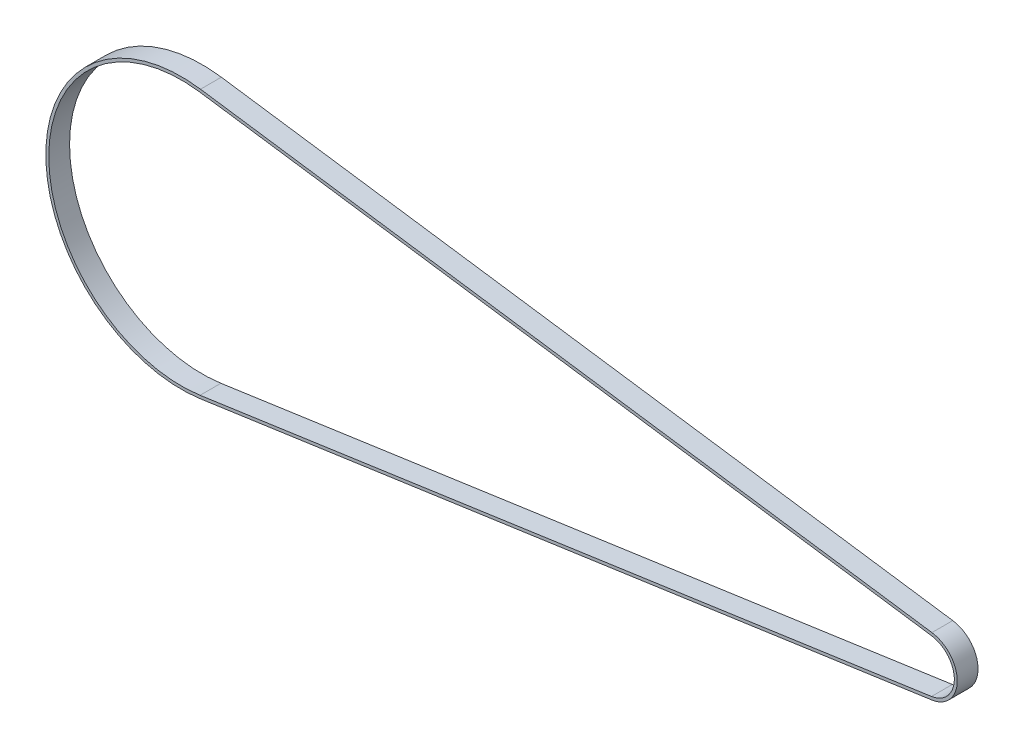
ISO-10303-21;
HEADER;
FILE_DESCRIPTION(('STEP AP214'),'2;1');
FILE_NAME('part.step','',(''),(''),'','','');
FILE_SCHEMA(('AUTOMOTIVE_DESIGN { 1 0 10303 214 1 1 1 1 }'));
ENDSEC;
DATA;
#1=APPLICATION_CONTEXT('core data for automotive mechanical design processes');
#2=APPLICATION_PROTOCOL_DEFINITION('international standard','automotive_design',2000,#1);
#3=PRODUCT_CONTEXT('',#1,'mechanical');
#4=PRODUCT('Part','Part','',(#3));
#5=PRODUCT_RELATED_PRODUCT_CATEGORY('part','',(#4));
#6=PRODUCT_DEFINITION_FORMATION('','',#4);
#7=PRODUCT_DEFINITION_CONTEXT('part definition',#1,'design');
#8=PRODUCT_DEFINITION('design','',#6,#7);
#9=PRODUCT_DEFINITION_SHAPE('','',#8);
#10=(LENGTH_UNIT() NAMED_UNIT(*) SI_UNIT(.MILLI.,.METRE.));
#11=(NAMED_UNIT(*) PLANE_ANGLE_UNIT() SI_UNIT($,.RADIAN.));
#12=(NAMED_UNIT(*) SI_UNIT($,.STERADIAN.) SOLID_ANGLE_UNIT());
#13=UNCERTAINTY_MEASURE_WITH_UNIT(LENGTH_MEASURE(1.E-05),#10,'distance_accuracy_value','');
#14=(GEOMETRIC_REPRESENTATION_CONTEXT(3) GLOBAL_UNCERTAINTY_ASSIGNED_CONTEXT((#13)) GLOBAL_UNIT_ASSIGNED_CONTEXT((#10,
#11,#12)) REPRESENTATION_CONTEXT('',''));
#15=CARTESIAN_POINT('',(0.,0.,0.));
#16=DIRECTION('',(0.,0.,1.));
#17=DIRECTION('',(1.,0.,0.));
#18=AXIS2_PLACEMENT_3D('',#15,#16,#17);
#19=CARTESIAN_POINT('',(-3.38618022510673E-12,4.9960036108132E-13,14.224));
#20=DIRECTION('',(0.,0.,-1.));
#21=DIRECTION('',(-1.,0.,0.));
#22=AXIS2_PLACEMENT_3D('',#19,#20,#21);
#23=PLANE('',#22);
#24=CARTESIAN_POINT('',(-3.38618022510673E-12,4.9960036108132E-13,14.224));
#25=DIRECTION('',(0.,0.,-1.));
#26=DIRECTION('',(-1.,0.,0.));
#27=AXIS2_PLACEMENT_3D('',#24,#25,#26);
#28=CIRCLE('',#27,20.161);
#29=CARTESIAN_POINT('',(2.86167605882014,-19.9568717772685,14.224));
#30=VERTEX_POINT('',#29);
#31=CARTESIAN_POINT('',(2.86167605882032,19.9568717772695,14.224));
#32=VERTEX_POINT('',#31);
#33=EDGE_CURVE('E160',#30,#32,#28,.F.);
#34=ORIENTED_EDGE('',*,*,#33,.T.);
#35=DIRECTION('',(-0.989875094353902,0.141941176470589,0.));
#36=VECTOR('',#35,1.);
#37=CARTESIAN_POINT('',(2.86167605882015,19.9568717772695,14.224));
#38=LINE('',#37,#36);
#39=CARTESIAN_POINT('',(-496.863202176473,91.6139298575486,14.224));
#40=VERTEX_POINT('',#39);
#41=EDGE_CURVE('E163',#32,#40,#38,.T.);
#42=ORIENTED_EDGE('',*,*,#41,.T.);
#43=CARTESIAN_POINT('',(-510.000000000003,6.66133814775094E-13,14.224));
#44=DIRECTION('',(0.,0.,-1.));
#45=DIRECTION('',(-1.,0.,0.));
#46=AXIS2_PLACEMENT_3D('',#43,#44,#45);
#47=CIRCLE('',#46,92.551);
#48=CARTESIAN_POINT('',(-496.863202176474,-91.6139298575473,14.224));
#49=VERTEX_POINT('',#48);
#50=EDGE_CURVE('E166',#40,#49,#47,.F.);
#51=ORIENTED_EDGE('',*,*,#50,.T.);
#52=DIRECTION('',(0.989875094353902,0.141941176470588,0.));
#53=VECTOR('',#52,1.);
#54=CARTESIAN_POINT('',(2.86167605882014,-19.9568717772685,14.224));
#55=LINE('',#54,#53);
#56=EDGE_CURVE('E168',#49,#30,#55,.T.);
#57=ORIENTED_EDGE('',*,*,#56,.T.);
#58=EDGE_LOOP('',(#34,#42,#51,#57));
#59=FACE_BOUND('',#58,.T.);
#60=CARTESIAN_POINT('',(-3.38618022510673E-12,4.9960036108132E-13,14.224));
#61=DIRECTION('',(0.,0.,1.));
#62=DIRECTION('',(-1.,0.,0.));
#63=AXIS2_PLACEMENT_3D('',#60,#61,#62);
#64=CIRCLE('',#63,18.161);
#65=CARTESIAN_POINT('',(2.57779370587896,-17.9771215885607,14.224));
#66=VERTEX_POINT('',#65);
#67=CARTESIAN_POINT('',(2.57779370587897,17.9771215885617,14.224));
#68=VERTEX_POINT('',#67);
#69=EDGE_CURVE('E124',#66,#68,#64,.T.);
#70=ORIENTED_EDGE('',*,*,#69,.F.);
#71=DIRECTION('',(0.989875094353902,0.141941176470588,0.));
#72=VECTOR('',#71,1.);
#73=CARTESIAN_POINT('',(2.57779370587896,-17.9771215885607,14.224));
#74=LINE('',#73,#72);
#75=CARTESIAN_POINT('',(-497.147084529415,-89.6341796688395,14.224));
#76=VERTEX_POINT('',#75);
#77=EDGE_CURVE('E146',#76,#66,#74,.T.);
#78=ORIENTED_EDGE('',*,*,#77,.F.);
#79=CARTESIAN_POINT('',(-510.000000000003,6.66133814775094E-13,14.224));
#80=DIRECTION('',(0.,0.,1.));
#81=DIRECTION('',(-1.,0.,0.));
#82=AXIS2_PLACEMENT_3D('',#79,#80,#81);
#83=CIRCLE('',#82,90.551);
#84=CARTESIAN_POINT('',(-497.147084529415,89.6341796688408,14.224));
#85=VERTEX_POINT('',#84);
#86=EDGE_CURVE('E144',#85,#76,#83,.T.);
#87=ORIENTED_EDGE('',*,*,#86,.F.);
#88=DIRECTION('',(-0.989875094353901,0.141941176470589,0.));
#89=VECTOR('',#88,1.);
#90=CARTESIAN_POINT('',(-497.147084529415,89.6341796688408,14.224));
#91=LINE('',#90,#89);
#92=EDGE_CURVE('E132',#68,#85,#91,.T.);
#93=ORIENTED_EDGE('',*,*,#92,.F.);
#94=EDGE_LOOP('',(#70,#78,#87,#93));
#95=FACE_BOUND('',#94,.T.);
#96=ADVANCED_FACE('F59',(#59,#95),#23,.F.);
#97=CARTESIAN_POINT('',(-3.38618022510673E-12,4.9960036108132E-13,0.));
#98=DIRECTION('',(0.,0.,-1.));
#99=DIRECTION('',(-1.,0.,0.));
#100=AXIS2_PLACEMENT_3D('',#97,#98,#99);
#101=PLANE('',#100);
#102=CARTESIAN_POINT('',(-3.38618022510673E-12,4.9960036108132E-13,0.));
#103=DIRECTION('',(0.,0.,-1.));
#104=DIRECTION('',(-1.,0.,0.));
#105=AXIS2_PLACEMENT_3D('',#102,#103,#104);
#106=CIRCLE('',#105,20.161);
#107=CARTESIAN_POINT('',(2.86167605882014,-19.9568717772685,0.));
#108=VERTEX_POINT('',#107);
#109=CARTESIAN_POINT('',(2.86167605882032,19.9568717772695,0.));
#110=VERTEX_POINT('',#109);
#111=EDGE_CURVE('E140',#108,#110,#106,.F.);
#112=ORIENTED_EDGE('',*,*,#111,.F.);
#113=DIRECTION('',(0.989875094353902,0.141941176470588,0.));
#114=VECTOR('',#113,1.);
#115=CARTESIAN_POINT('',(2.86167605882014,-19.9568717772685,0.));
#116=LINE('',#115,#114);
#117=CARTESIAN_POINT('',(-496.863202176474,-91.6139298575473,0.));
#118=VERTEX_POINT('',#117);
#119=EDGE_CURVE('E164',#118,#108,#116,.T.);
#120=ORIENTED_EDGE('',*,*,#119,.F.);
#121=CARTESIAN_POINT('',(-510.000000000003,6.66133814775094E-13,0.));
#122=DIRECTION('',(0.,0.,-1.));
#123=DIRECTION('',(-1.,0.,0.));
#124=AXIS2_PLACEMENT_3D('',#121,#122,#123);
#125=CIRCLE('',#124,92.551);
#126=CARTESIAN_POINT('',(-496.863202176473,91.6139298575486,0.));
#127=VERTEX_POINT('',#126);
#128=EDGE_CURVE('E175',#127,#118,#125,.F.);
#129=ORIENTED_EDGE('',*,*,#128,.F.);
#130=DIRECTION('',(-0.989875094353902,0.141941176470589,0.));
#131=VECTOR('',#130,1.);
#132=CARTESIAN_POINT('',(2.86167605882015,19.9568717772695,0.));
#133=LINE('',#132,#131);
#134=EDGE_CURVE('E173',#110,#127,#133,.T.);
#135=ORIENTED_EDGE('',*,*,#134,.F.);
#136=EDGE_LOOP('',(#112,#120,#129,#135));
#137=FACE_BOUND('',#136,.T.);
#138=DIRECTION('',(0.989875094353902,0.141941176470588,0.));
#139=VECTOR('',#138,1.);
#140=CARTESIAN_POINT('',(2.57779370587896,-17.9771215885607,0.));
#141=LINE('',#140,#139);
#142=CARTESIAN_POINT('',(-497.147084529415,-89.6341796688395,0.));
#143=VERTEX_POINT('',#142);
#144=CARTESIAN_POINT('',(2.57779370587896,-17.9771215885607,0.));
#145=VERTEX_POINT('',#144);
#146=EDGE_CURVE('E133',#143,#145,#141,.T.);
#147=ORIENTED_EDGE('',*,*,#146,.T.);
#148=CARTESIAN_POINT('',(-3.38618022510673E-12,4.9960036108132E-13,0.));
#149=DIRECTION('',(0.,0.,1.));
#150=DIRECTION('',(-1.,0.,0.));
#151=AXIS2_PLACEMENT_3D('',#148,#149,#150);
#152=CIRCLE('',#151,18.161);
#153=CARTESIAN_POINT('',(2.57779370587897,17.9771215885617,0.));
#154=VERTEX_POINT('',#153);
#155=EDGE_CURVE('E82',#145,#154,#152,.T.);
#156=ORIENTED_EDGE('',*,*,#155,.T.);
#157=DIRECTION('',(-0.989875094353901,0.141941176470589,0.));
#158=VECTOR('',#157,1.);
#159=CARTESIAN_POINT('',(-497.147084529415,89.6341796688408,0.));
#160=LINE('',#159,#158);
#161=CARTESIAN_POINT('',(-497.147084529415,89.6341796688408,0.));
#162=VERTEX_POINT('',#161);
#163=EDGE_CURVE('E139',#154,#162,#160,.T.);
#164=ORIENTED_EDGE('',*,*,#163,.T.);
#165=CARTESIAN_POINT('',(-510.000000000003,6.66133814775094E-13,0.));
#166=DIRECTION('',(0.,0.,1.));
#167=DIRECTION('',(-1.,0.,0.));
#168=AXIS2_PLACEMENT_3D('',#165,#166,#167);
#169=CIRCLE('',#168,90.551);
#170=EDGE_CURVE('E152',#162,#143,#169,.T.);
#171=ORIENTED_EDGE('',*,*,#170,.T.);
#172=EDGE_LOOP('',(#147,#156,#164,#171));
#173=FACE_BOUND('',#172,.T.);
#174=ADVANCED_FACE('F193',(#137,#173),#101,.T.);
#175=CARTESIAN_POINT('',(-3.38618022510673E-12,4.9960036108132E-13,14.224));
#176=DIRECTION('',(0.,0.,-1.));
#177=DIRECTION('',(-1.,0.,0.));
#178=AXIS2_PLACEMENT_3D('',#175,#176,#177);
#179=CYLINDRICAL_SURFACE('',#178,20.161);
#180=ORIENTED_EDGE('',*,*,#111,.T.);
#181=DIRECTION('',(0.,0.,-1.));
#182=VECTOR('',#181,1.);
#183=CARTESIAN_POINT('',(2.86167605882032,19.9568717772695,14.224));
#184=LINE('',#183,#182);
#185=EDGE_CURVE('E12',#32,#110,#184,.T.);
#186=ORIENTED_EDGE('',*,*,#185,.F.);
#187=ORIENTED_EDGE('',*,*,#33,.F.);
#188=DIRECTION('',(0.,0.,-1.));
#189=VECTOR('',#188,1.);
#190=CARTESIAN_POINT('',(2.86167605882014,-19.9568717772685,14.224));
#191=LINE('',#190,#189);
#192=EDGE_CURVE('E170',#30,#108,#191,.T.);
#193=ORIENTED_EDGE('',*,*,#192,.T.);
#194=EDGE_LOOP('',(#180,#186,#187,#193));
#195=FACE_BOUND('',#194,.T.);
#196=ADVANCED_FACE('F61',(#195),#179,.T.);
#197=CARTESIAN_POINT('',(2.86167605882015,19.9568717772695,14.224));
#198=DIRECTION('',(-0.141941176470589,-0.989875094353902,0.));
#199=DIRECTION('',(0.989875094353902,-0.141941176470589,0.));
#200=AXIS2_PLACEMENT_3D('',#197,#198,#199);
#201=PLANE('',#200);
#202=ORIENTED_EDGE('',*,*,#134,.T.);
#203=DIRECTION('',(0.,0.,-1.));
#204=VECTOR('',#203,1.);
#205=CARTESIAN_POINT('',(-496.863202176473,91.6139298575486,14.224));
#206=LINE('',#205,#204);
#207=EDGE_CURVE('E67',#40,#127,#206,.T.);
#208=ORIENTED_EDGE('',*,*,#207,.F.);
#209=ORIENTED_EDGE('',*,*,#41,.F.);
#210=ORIENTED_EDGE('',*,*,#185,.T.);
#211=EDGE_LOOP('',(#202,#208,#209,#210));
#212=FACE_BOUND('',#211,.T.);
#213=ADVANCED_FACE('F203',(#212),#201,.F.);
#214=CARTESIAN_POINT('',(-510.000000000003,6.66133814775094E-13,14.224));
#215=DIRECTION('',(0.,0.,-1.));
#216=DIRECTION('',(-1.,0.,0.));
#217=AXIS2_PLACEMENT_3D('',#214,#215,#216);
#218=CYLINDRICAL_SURFACE('',#217,92.551);
#219=ORIENTED_EDGE('',*,*,#128,.T.);
#220=DIRECTION('',(0.,0.,-1.));
#221=VECTOR('',#220,1.);
#222=CARTESIAN_POINT('',(-496.863202176474,-91.6139298575473,14.224));
#223=LINE('',#222,#221);
#224=EDGE_CURVE('E180',#49,#118,#223,.T.);
#225=ORIENTED_EDGE('',*,*,#224,.F.);
#226=ORIENTED_EDGE('',*,*,#50,.F.);
#227=ORIENTED_EDGE('',*,*,#207,.T.);
#228=EDGE_LOOP('',(#219,#225,#226,#227));
#229=FACE_BOUND('',#228,.T.);
#230=ADVANCED_FACE('F187',(#229),#218,.T.);
#231=CARTESIAN_POINT('',(2.86167605882014,-19.9568717772685,14.224));
#232=DIRECTION('',(-0.141941176470588,0.989875094353902,0.));
#233=DIRECTION('',(-0.989875094353902,-0.141941176470588,0.));
#234=AXIS2_PLACEMENT_3D('',#231,#232,#233);
#235=PLANE('',#234);
#236=ORIENTED_EDGE('',*,*,#119,.T.);
#237=ORIENTED_EDGE('',*,*,#192,.F.);
#238=ORIENTED_EDGE('',*,*,#56,.F.);
#239=ORIENTED_EDGE('',*,*,#224,.T.);
#240=EDGE_LOOP('',(#236,#237,#238,#239));
#241=FACE_BOUND('',#240,.T.);
#242=ADVANCED_FACE('F197',(#241),#235,.F.);
#243=CARTESIAN_POINT('',(-3.38618022510673E-12,4.9960036108132E-13,14.224));
#244=DIRECTION('',(0.,0.,-1.));
#245=DIRECTION('',(-1.,0.,0.));
#246=AXIS2_PLACEMENT_3D('',#243,#244,#245);
#247=CYLINDRICAL_SURFACE('',#246,18.161);
#248=ORIENTED_EDGE('',*,*,#155,.F.);
#249=DIRECTION('',(0.,0.,-1.));
#250=VECTOR('',#249,1.);
#251=CARTESIAN_POINT('',(2.57779370587896,-17.9771215885607,14.224));
#252=LINE('',#251,#250);
#253=EDGE_CURVE('E128',#66,#145,#252,.T.);
#254=ORIENTED_EDGE('',*,*,#253,.F.);
#255=ORIENTED_EDGE('',*,*,#69,.T.);
#256=DIRECTION('',(0.,0.,-1.));
#257=VECTOR('',#256,1.);
#258=CARTESIAN_POINT('',(2.57779370587897,17.9771215885617,14.224));
#259=LINE('',#258,#257);
#260=EDGE_CURVE('E127',#68,#154,#259,.T.);
#261=ORIENTED_EDGE('',*,*,#260,.T.);
#262=EDGE_LOOP('',(#248,#254,#255,#261));
#263=FACE_BOUND('',#262,.T.);
#264=ADVANCED_FACE('F126',(#263),#247,.F.);
#265=CARTESIAN_POINT('',(-497.147084529415,89.6341796688408,14.224));
#266=DIRECTION('',(-0.141941176470589,-0.989875094353901,0.));
#267=DIRECTION('',(0.989875094353901,-0.141941176470589,0.));
#268=AXIS2_PLACEMENT_3D('',#265,#266,#267);
#269=PLANE('',#268);
#270=ORIENTED_EDGE('',*,*,#163,.F.);
#271=ORIENTED_EDGE('',*,*,#260,.F.);
#272=ORIENTED_EDGE('',*,*,#92,.T.);
#273=DIRECTION('',(0.,0.,-1.));
#274=VECTOR('',#273,1.);
#275=CARTESIAN_POINT('',(-497.147084529415,89.6341796688408,14.224));
#276=LINE('',#275,#274);
#277=EDGE_CURVE('E141',#85,#162,#276,.T.);
#278=ORIENTED_EDGE('',*,*,#277,.T.);
#279=EDGE_LOOP('',(#270,#271,#272,#278));
#280=FACE_BOUND('',#279,.T.);
#281=ADVANCED_FACE('F136',(#280),#269,.T.);
#282=CARTESIAN_POINT('',(-510.000000000003,6.66133814775094E-13,14.224));
#283=DIRECTION('',(0.,0.,-1.));
#284=DIRECTION('',(-1.,0.,0.));
#285=AXIS2_PLACEMENT_3D('',#282,#283,#284);
#286=CYLINDRICAL_SURFACE('',#285,90.551);
#287=ORIENTED_EDGE('',*,*,#170,.F.);
#288=ORIENTED_EDGE('',*,*,#277,.F.);
#289=ORIENTED_EDGE('',*,*,#86,.T.);
#290=DIRECTION('',(0.,0.,-1.));
#291=VECTOR('',#290,1.);
#292=CARTESIAN_POINT('',(-497.147084529415,-89.6341796688395,14.224));
#293=LINE('',#292,#291);
#294=EDGE_CURVE('E74',#76,#143,#293,.T.);
#295=ORIENTED_EDGE('',*,*,#294,.T.);
#296=EDGE_LOOP('',(#287,#288,#289,#295));
#297=FACE_BOUND('',#296,.T.);
#298=ADVANCED_FACE('F226',(#297),#286,.F.);
#299=CARTESIAN_POINT('',(2.57779370587896,-17.9771215885607,14.224));
#300=DIRECTION('',(-0.141941176470588,0.989875094353902,0.));
#301=DIRECTION('',(-0.989875094353902,-0.141941176470588,0.));
#302=AXIS2_PLACEMENT_3D('',#299,#300,#301);
#303=PLANE('',#302);
#304=ORIENTED_EDGE('',*,*,#146,.F.);
#305=ORIENTED_EDGE('',*,*,#294,.F.);
#306=ORIENTED_EDGE('',*,*,#77,.T.);
#307=ORIENTED_EDGE('',*,*,#253,.T.);
#308=EDGE_LOOP('',(#304,#305,#306,#307));
#309=FACE_BOUND('',#308,.T.);
#310=ADVANCED_FACE('F230',(#309),#303,.T.);
#311=CLOSED_SHELL('',(#96,#174,#196,#213,#230,#242,#264,#281,#298,#310));
#312=MANIFOLD_SOLID_BREP('B2',#311);
#313=ADVANCED_BREP_SHAPE_REPRESENTATION('',(#18,#312),#14);
#314=SHAPE_DEFINITION_REPRESENTATION(#9,#313);
ENDSEC;
END-ISO-10303-21;
